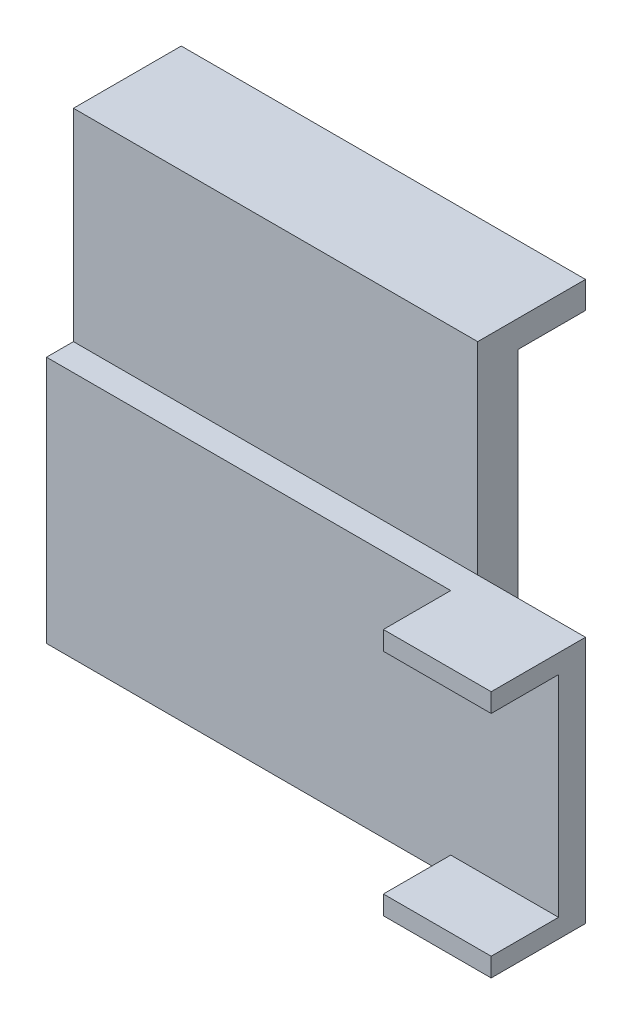
ISO-10303-21;
HEADER;
FILE_DESCRIPTION(('STEP AP214'),'2;1');
FILE_NAME('part.step','',(''),(''),'','','');
FILE_SCHEMA(('AUTOMOTIVE_DESIGN { 1 0 10303 214 1 1 1 1 }'));
ENDSEC;
DATA;
#1=APPLICATION_CONTEXT('core data for automotive mechanical design processes');
#2=APPLICATION_PROTOCOL_DEFINITION('international standard','automotive_design',2000,#1);
#3=PRODUCT_CONTEXT('',#1,'mechanical');
#4=PRODUCT('Part','Part','',(#3));
#5=PRODUCT_RELATED_PRODUCT_CATEGORY('part','',(#4));
#6=PRODUCT_DEFINITION_FORMATION('','',#4);
#7=PRODUCT_DEFINITION_CONTEXT('part definition',#1,'design');
#8=PRODUCT_DEFINITION('design','',#6,#7);
#9=PRODUCT_DEFINITION_SHAPE('','',#8);
#10=(LENGTH_UNIT() NAMED_UNIT(*) SI_UNIT(.MILLI.,.METRE.));
#11=(NAMED_UNIT(*) PLANE_ANGLE_UNIT() SI_UNIT($,.RADIAN.));
#12=(NAMED_UNIT(*) SI_UNIT($,.STERADIAN.) SOLID_ANGLE_UNIT());
#13=UNCERTAINTY_MEASURE_WITH_UNIT(LENGTH_MEASURE(1.E-05),#10,'distance_accuracy_value','');
#14=(GEOMETRIC_REPRESENTATION_CONTEXT(3) GLOBAL_UNCERTAINTY_ASSIGNED_CONTEXT((#13)) GLOBAL_UNIT_ASSIGNED_CONTEXT((#10,
#11,#12)) REPRESENTATION_CONTEXT('',''));
#15=CARTESIAN_POINT('',(0.,0.,0.));
#16=DIRECTION('',(0.,0.,1.));
#17=DIRECTION('',(1.,0.,0.));
#18=AXIS2_PLACEMENT_3D('',#15,#16,#17);
#19=CARTESIAN_POINT('',(0.0862789967610667,-0.155598995100074,-3.86375218835645));
#20=DIRECTION('',(0.,0.,1.));
#21=DIRECTION('',(1.,0.,0.));
#22=AXIS2_PLACEMENT_3D('',#19,#20,#21);
#23=PLANE('',#22);
#24=DIRECTION('',(-1.,0.,0.));
#25=VECTOR('',#24,1.);
#26=CARTESIAN_POINT('',(13.0402789967611,28.6022810048999,-3.86375218835645));
#27=LINE('',#26,#25);
#28=CARTESIAN_POINT('',(13.0402789967611,28.6022810048999,-3.86375218835645));
#29=VERTEX_POINT('',#28);
#30=CARTESIAN_POINT('',(-25.8217210032389,28.6022810048999,-3.86375218835645));
#31=VERTEX_POINT('',#30);
#32=EDGE_CURVE('E53',#29,#31,#27,.T.);
#33=ORIENTED_EDGE('',*,*,#32,.F.);
#34=DIRECTION('',(0.,-1.,0.));
#35=VECTOR('',#34,1.);
#36=CARTESIAN_POINT('',(13.0402789967611,11.7620810048999,-3.86375218835645));
#37=LINE('',#36,#35);
#38=CARTESIAN_POINT('',(13.0402789967611,-12.0732789951001,-3.86375218835645));
#39=VERTEX_POINT('',#38);
#40=EDGE_CURVE('E171',#29,#39,#37,.T.);
#41=ORIENTED_EDGE('',*,*,#40,.T.);
#42=DIRECTION('',(-1.,0.,0.));
#43=VECTOR('',#42,1.);
#44=CARTESIAN_POINT('',(-25.8217210032389,-12.0732789951001,-3.86375218835645));
#45=LINE('',#44,#43);
#46=CARTESIAN_POINT('',(-25.8217210032389,-12.0732789951001,-3.86375218835645));
#47=VERTEX_POINT('',#46);
#48=EDGE_CURVE('E183',#39,#47,#45,.T.);
#49=ORIENTED_EDGE('',*,*,#48,.T.);
#50=DIRECTION('',(0.,1.,0.));
#51=VECTOR('',#50,1.);
#52=CARTESIAN_POINT('',(-25.8217210032389,11.7620810048999,-3.86375218835645));
#53=LINE('',#52,#51);
#54=EDGE_CURVE('E179',#47,#31,#53,.T.);
#55=ORIENTED_EDGE('',*,*,#54,.T.);
#56=EDGE_LOOP('',(#33,#41,#49,#55));
#57=FACE_BOUND('',#56,.T.);
#58=ADVANCED_FACE('F36',(#57),#23,.F.);
#59=CARTESIAN_POINT('',(0.0862789967610667,-0.155598995100074,2.61324781164355));
#60=DIRECTION('',(0.,0.,-1.));
#61=DIRECTION('',(-1.,0.,0.));
#62=AXIS2_PLACEMENT_3D('',#59,#60,#61);
#63=PLANE('',#62);
#64=DIRECTION('',(-1.,0.,0.));
#65=VECTOR('',#64,1.);
#66=CARTESIAN_POINT('',(25.9942789967611,-10.2597189951001,2.61324781164355));
#67=LINE('',#66,#65);
#68=CARTESIAN_POINT('',(23.4034789967611,-10.2597189951001,2.61324781164355));
#69=VERTEX_POINT('',#68);
#70=CARTESIAN_POINT('',(13.0402789967611,-10.2597189951001,2.61324781164355));
#71=VERTEX_POINT('',#70);
#72=EDGE_CURVE('E215',#69,#71,#67,.T.);
#73=ORIENTED_EDGE('',*,*,#72,.F.);
#74=DIRECTION('',(0.,1.,0.));
#75=VECTOR('',#74,1.);
#76=CARTESIAN_POINT('',(23.4034789967611,-0.155598995100074,2.61324781164355));
#77=LINE('',#76,#75);
#78=CARTESIAN_POINT('',(23.4034789967611,9.94852100489993,2.61324781164355));
#79=VERTEX_POINT('',#78);
#80=EDGE_CURVE('E209',#69,#79,#77,.T.);
#81=ORIENTED_EDGE('',*,*,#80,.T.);
#82=DIRECTION('',(1.,0.,0.));
#83=VECTOR('',#82,1.);
#84=CARTESIAN_POINT('',(25.9942789967611,9.94852100489993,2.61324781164355));
#85=LINE('',#84,#83);
#86=CARTESIAN_POINT('',(13.0402789967611,9.94852100489993,2.61324781164355));
#87=VERTEX_POINT('',#86);
#88=EDGE_CURVE('E237',#87,#79,#85,.T.);
#89=ORIENTED_EDGE('',*,*,#88,.F.);
#90=DIRECTION('',(0.,-1.,0.));
#91=VECTOR('',#90,1.);
#92=CARTESIAN_POINT('',(13.0402789967611,11.7620810048999,2.61324781164355));
#93=LINE('',#92,#91);
#94=CARTESIAN_POINT('',(13.0402789967611,11.7620810048999,2.61324781164355));
#95=VERTEX_POINT('',#94);
#96=EDGE_CURVE('E233',#95,#87,#93,.T.);
#97=ORIENTED_EDGE('',*,*,#96,.F.);
#98=DIRECTION('',(-1.,0.,0.));
#99=VECTOR('',#98,1.);
#100=CARTESIAN_POINT('',(-25.8217210032389,11.7620810048999,2.61324781164355));
#101=LINE('',#100,#99);
#102=CARTESIAN_POINT('',(-25.8217210032389,11.7620810048999,2.61324781164355));
#103=VERTEX_POINT('',#102);
#104=EDGE_CURVE('E253',#95,#103,#101,.T.);
#105=ORIENTED_EDGE('',*,*,#104,.T.);
#106=DIRECTION('',(0.,-1.,0.));
#107=VECTOR('',#106,1.);
#108=CARTESIAN_POINT('',(-25.8217210032389,-12.0732789951001,2.61324781164355));
#109=LINE('',#108,#107);
#110=CARTESIAN_POINT('',(-25.8217210032389,-12.0732789951001,2.61324781164355));
#111=VERTEX_POINT('',#110);
#112=EDGE_CURVE('E255',#103,#111,#109,.T.);
#113=ORIENTED_EDGE('',*,*,#112,.T.);
#114=DIRECTION('',(1.,0.,0.));
#115=VECTOR('',#114,1.);
#116=CARTESIAN_POINT('',(-25.8217210032389,-12.0732789951001,2.61324781164355));
#117=LINE('',#116,#115);
#118=CARTESIAN_POINT('',(13.0402789967611,-12.0732789951001,2.61324781164355));
#119=VERTEX_POINT('',#118);
#120=EDGE_CURVE('E258',#111,#119,#117,.T.);
#121=ORIENTED_EDGE('',*,*,#120,.T.);
#122=DIRECTION('',(0.,-1.,0.));
#123=VECTOR('',#122,1.);
#124=CARTESIAN_POINT('',(13.0402789967611,-12.0732789951001,2.61324781164355));
#125=LINE('',#124,#123);
#126=EDGE_CURVE('E219',#71,#119,#125,.T.);
#127=ORIENTED_EDGE('',*,*,#126,.F.);
#128=EDGE_LOOP('',(#73,#81,#89,#97,#105,#113,#121,#127));
#129=FACE_BOUND('',#128,.T.);
#130=ADVANCED_FACE('F304',(#129),#63,.F.);
#131=CARTESIAN_POINT('',(-25.8217210032389,11.7620810048999,2.61324781164355));
#132=DIRECTION('',(0.,-1.,0.));
#133=DIRECTION('',(0.,0.,-1.));
#134=AXIS2_PLACEMENT_3D('',#131,#132,#133);
#135=PLANE('',#134);
#136=DIRECTION('',(-1.,0.,0.));
#137=VECTOR('',#136,1.);
#138=CARTESIAN_POINT('',(25.9942789967611,11.7620810048999,9.09024781164355));
#139=LINE('',#138,#137);
#140=CARTESIAN_POINT('',(23.4034789967611,11.7620810048999,9.09024781164355));
#141=VERTEX_POINT('',#140);
#142=CARTESIAN_POINT('',(13.0402789967611,11.7620810048999,9.09024781164355));
#143=VERTEX_POINT('',#142);
#144=EDGE_CURVE('E234',#141,#143,#139,.T.);
#145=ORIENTED_EDGE('',*,*,#144,.F.);
#146=DIRECTION('',(0.,0.,1.));
#147=VECTOR('',#146,1.);
#148=CARTESIAN_POINT('',(23.4034789967611,11.7620810048999,9.09024781164355));
#149=LINE('',#148,#147);
#150=CARTESIAN_POINT('',(23.4034789967611,11.7620810048999,0.0224478116435521));
#151=VERTEX_POINT('',#150);
#152=EDGE_CURVE('E195',#151,#141,#149,.T.);
#153=ORIENTED_EDGE('',*,*,#152,.F.);
#154=DIRECTION('',(-1.,0.,0.));
#155=VECTOR('',#154,1.);
#156=CARTESIAN_POINT('',(-25.8217210032389,11.7620810048999,0.0224478116435513));
#157=LINE('',#156,#155);
#158=CARTESIAN_POINT('',(13.0402789967611,11.7620810048999,0.0224478116435513));
#159=VERTEX_POINT('',#158);
#160=EDGE_CURVE('E261',#151,#159,#157,.T.);
#161=ORIENTED_EDGE('',*,*,#160,.T.);
#162=CARTESIAN_POINT('',(-25.8217210032389,11.7620810048999,0.0224478116435513));
#163=VERTEX_POINT('',#162);
#164=EDGE_CURVE('E252',#159,#163,#157,.T.);
#165=ORIENTED_EDGE('',*,*,#164,.T.);
#166=DIRECTION('',(0.,0.,-1.));
#167=VECTOR('',#166,1.);
#168=CARTESIAN_POINT('',(-25.8217210032389,11.7620810048999,2.61324781164355));
#169=LINE('',#168,#167);
#170=EDGE_CURVE('E40',#103,#163,#169,.T.);
#171=ORIENTED_EDGE('',*,*,#170,.F.);
#172=ORIENTED_EDGE('',*,*,#104,.F.);
#173=DIRECTION('',(0.,0.,-1.));
#174=VECTOR('',#173,1.);
#175=CARTESIAN_POINT('',(13.0402789967611,11.7620810048999,9.09024781164355));
#176=LINE('',#175,#174);
#177=EDGE_CURVE('E249',#143,#95,#176,.T.);
#178=ORIENTED_EDGE('',*,*,#177,.F.);
#179=EDGE_LOOP('',(#145,#153,#161,#165,#171,#172,#178));
#180=FACE_BOUND('',#179,.T.);
#181=ADVANCED_FACE('F38',(#180),#135,.F.);
#182=CARTESIAN_POINT('',(-25.8217210032389,-12.0732789951001,2.61324781164355));
#183=DIRECTION('',(1.,0.,0.));
#184=DIRECTION('',(0.,0.,-1.));
#185=AXIS2_PLACEMENT_3D('',#182,#183,#184);
#186=PLANE('',#185);
#187=ORIENTED_EDGE('',*,*,#170,.T.);
#188=DIRECTION('',(0.,1.,0.));
#189=VECTOR('',#188,1.);
#190=CARTESIAN_POINT('',(-25.8217210032389,11.7620810048999,0.0224478116435513));
#191=LINE('',#190,#189);
#192=CARTESIAN_POINT('',(-25.8217210032389,31.1930810048999,0.0224478116435513));
#193=VERTEX_POINT('',#192);
#194=EDGE_CURVE('E181',#163,#193,#191,.T.);
#195=ORIENTED_EDGE('',*,*,#194,.T.);
#196=DIRECTION('',(0.,0.,1.));
#197=VECTOR('',#196,1.);
#198=CARTESIAN_POINT('',(-25.8217210032389,31.1930810048999,-3.86375218835645));
#199=LINE('',#198,#197);
#200=CARTESIAN_POINT('',(-25.8217210032389,31.1930810048999,-10.3407521883564));
#201=VERTEX_POINT('',#200);
#202=EDGE_CURVE('E192',#201,#193,#199,.T.);
#203=ORIENTED_EDGE('',*,*,#202,.F.);
#204=DIRECTION('',(0.,1.,0.));
#205=VECTOR('',#204,1.);
#206=CARTESIAN_POINT('',(-25.8217210032389,31.1930810048999,-10.3407521883564));
#207=LINE('',#206,#205);
#208=CARTESIAN_POINT('',(-25.8217210032389,28.6022810048999,-10.3407521883564));
#209=VERTEX_POINT('',#208);
#210=EDGE_CURVE('E157',#209,#201,#207,.T.);
#211=ORIENTED_EDGE('',*,*,#210,.F.);
#212=DIRECTION('',(0.,0.,1.));
#213=VECTOR('',#212,1.);
#214=CARTESIAN_POINT('',(-25.8217210032389,28.6022810048999,-10.3407521883564));
#215=LINE('',#214,#213);
#216=EDGE_CURVE('E153',#209,#31,#215,.T.);
#217=ORIENTED_EDGE('',*,*,#216,.T.);
#218=ORIENTED_EDGE('',*,*,#54,.F.);
#219=DIRECTION('',(0.,0.,-1.));
#220=VECTOR('',#219,1.);
#221=CARTESIAN_POINT('',(-25.8217210032389,-12.0732789951001,2.61324781164355));
#222=LINE('',#221,#220);
#223=EDGE_CURVE('E260',#111,#47,#222,.T.);
#224=ORIENTED_EDGE('',*,*,#223,.F.);
#225=ORIENTED_EDGE('',*,*,#112,.F.);
#226=EDGE_LOOP('',(#187,#195,#203,#211,#217,#218,#224,#225));
#227=FACE_BOUND('',#226,.T.);
#228=ADVANCED_FACE('F273',(#227),#186,.F.);
#229=CARTESIAN_POINT('',(-25.8217210032389,-12.0732789951001,2.61324781164355));
#230=DIRECTION('',(0.,1.,0.));
#231=DIRECTION('',(0.,0.,1.));
#232=AXIS2_PLACEMENT_3D('',#229,#230,#231);
#233=PLANE('',#232);
#234=ORIENTED_EDGE('',*,*,#223,.T.);
#235=ORIENTED_EDGE('',*,*,#48,.F.);
#236=DIRECTION('',(0.,0.,1.));
#237=VECTOR('',#236,1.);
#238=CARTESIAN_POINT('',(13.0402789967611,-12.0732789951001,-3.86375218835645));
#239=LINE('',#238,#237);
#240=CARTESIAN_POINT('',(13.0402789967611,-12.0732789951001,0.0224478116435513));
#241=VERTEX_POINT('',#240);
#242=EDGE_CURVE('E185',#39,#241,#239,.T.);
#243=ORIENTED_EDGE('',*,*,#242,.T.);
#244=DIRECTION('',(1.,0.,0.));
#245=VECTOR('',#244,1.);
#246=CARTESIAN_POINT('',(-25.8217210032389,-12.0732789951001,0.0224478116435513));
#247=LINE('',#246,#245);
#248=CARTESIAN_POINT('',(23.4034789967611,-12.0732789951001,0.0224478116435521));
#249=VERTEX_POINT('',#248);
#250=EDGE_CURVE('E256',#241,#249,#247,.T.);
#251=ORIENTED_EDGE('',*,*,#250,.T.);
#252=DIRECTION('',(0.,0.,1.));
#253=VECTOR('',#252,1.);
#254=CARTESIAN_POINT('',(23.4034789967611,-12.0732789951001,9.09024781164355));
#255=LINE('',#254,#253);
#256=CARTESIAN_POINT('',(23.4034789967611,-12.0732789951001,9.09024781164355));
#257=VERTEX_POINT('',#256);
#258=EDGE_CURVE('E196',#249,#257,#255,.T.);
#259=ORIENTED_EDGE('',*,*,#258,.T.);
#260=DIRECTION('',(1.,0.,0.));
#261=VECTOR('',#260,1.);
#262=CARTESIAN_POINT('',(25.9942789967611,-12.0732789951001,9.09024781164355));
#263=LINE('',#262,#261);
#264=CARTESIAN_POINT('',(13.0402789967611,-12.0732789951001,9.09024781164355));
#265=VERTEX_POINT('',#264);
#266=EDGE_CURVE('E221',#265,#257,#263,.T.);
#267=ORIENTED_EDGE('',*,*,#266,.F.);
#268=DIRECTION('',(0.,0.,-1.));
#269=VECTOR('',#268,1.);
#270=CARTESIAN_POINT('',(13.0402789967611,-12.0732789951001,9.09024781164355));
#271=LINE('',#270,#269);
#272=EDGE_CURVE('E224',#265,#119,#271,.T.);
#273=ORIENTED_EDGE('',*,*,#272,.T.);
#274=ORIENTED_EDGE('',*,*,#120,.F.);
#275=EDGE_LOOP('',(#234,#235,#243,#251,#259,#267,#273,#274));
#276=FACE_BOUND('',#275,.T.);
#277=ADVANCED_FACE('F284',(#276),#233,.F.);
#278=CARTESIAN_POINT('',(0.0862789967610667,-0.155598995100074,0.0224478116435513));
#279=DIRECTION('',(0.,0.,-1.));
#280=DIRECTION('',(-1.,0.,0.));
#281=AXIS2_PLACEMENT_3D('',#278,#279,#280);
#282=PLANE('',#281);
#283=DIRECTION('',(0.,-1.,0.));
#284=VECTOR('',#283,1.);
#285=CARTESIAN_POINT('',(13.0402789967611,11.7620810048999,0.0224478116435513));
#286=LINE('',#285,#284);
#287=EDGE_CURVE('E11',#159,#241,#286,.T.);
#288=ORIENTED_EDGE('',*,*,#287,.F.);
#289=ORIENTED_EDGE('',*,*,#160,.F.);
#290=DIRECTION('',(0.,1.,0.));
#291=VECTOR('',#290,1.);
#292=CARTESIAN_POINT('',(23.4034789967611,-12.0732789951001,0.0224478116435521));
#293=LINE('',#292,#291);
#294=EDGE_CURVE('E199',#249,#151,#293,.T.);
#295=ORIENTED_EDGE('',*,*,#294,.F.);
#296=ORIENTED_EDGE('',*,*,#250,.F.);
#297=EDGE_LOOP('',(#288,#289,#295,#296));
#298=FACE_BOUND('',#297,.T.);
#299=ADVANCED_FACE('F291',(#298),#282,.T.);
#300=CARTESIAN_POINT('',(13.0402789967611,11.7620810048999,9.09024781164355));
#301=DIRECTION('',(1.,0.,0.));
#302=DIRECTION('',(0.,0.,-1.));
#303=AXIS2_PLACEMENT_3D('',#300,#301,#302);
#304=PLANE('',#303);
#305=ORIENTED_EDGE('',*,*,#96,.T.);
#306=DIRECTION('',(0.,0.,-1.));
#307=VECTOR('',#306,1.);
#308=CARTESIAN_POINT('',(13.0402789967611,9.94852100489993,9.09024781164355));
#309=LINE('',#308,#307);
#310=CARTESIAN_POINT('',(13.0402789967611,9.94852100489993,9.09024781164355));
#311=VERTEX_POINT('',#310);
#312=EDGE_CURVE('E242',#311,#87,#309,.T.);
#313=ORIENTED_EDGE('',*,*,#312,.F.);
#314=DIRECTION('',(0.,-1.,0.));
#315=VECTOR('',#314,1.);
#316=CARTESIAN_POINT('',(13.0402789967611,11.7620810048999,9.09024781164355));
#317=LINE('',#316,#315);
#318=EDGE_CURVE('E236',#143,#311,#317,.T.);
#319=ORIENTED_EDGE('',*,*,#318,.F.);
#320=ORIENTED_EDGE('',*,*,#177,.T.);
#321=EDGE_LOOP('',(#305,#313,#319,#320));
#322=FACE_BOUND('',#321,.T.);
#323=ADVANCED_FACE('F424',(#322),#304,.F.);
#324=CARTESIAN_POINT('',(25.9942789967611,9.94852100489993,9.09024781164355));
#325=DIRECTION('',(0.,1.,0.));
#326=DIRECTION('',(-1.,0.,0.));
#327=AXIS2_PLACEMENT_3D('',#324,#325,#326);
#328=PLANE('',#327);
#329=ORIENTED_EDGE('',*,*,#88,.T.);
#330=DIRECTION('',(0.,0.,1.));
#331=VECTOR('',#330,1.);
#332=CARTESIAN_POINT('',(23.4034789967611,9.94852100489993,9.09024781164355));
#333=LINE('',#332,#331);
#334=CARTESIAN_POINT('',(23.4034789967611,9.94852100489993,9.09024781164355));
#335=VERTEX_POINT('',#334);
#336=EDGE_CURVE('E212',#79,#335,#333,.T.);
#337=ORIENTED_EDGE('',*,*,#336,.T.);
#338=DIRECTION('',(1.,0.,0.));
#339=VECTOR('',#338,1.);
#340=CARTESIAN_POINT('',(25.9942789967611,9.94852100489993,9.09024781164355));
#341=LINE('',#340,#339);
#342=EDGE_CURVE('E239',#311,#335,#341,.T.);
#343=ORIENTED_EDGE('',*,*,#342,.F.);
#344=ORIENTED_EDGE('',*,*,#312,.T.);
#345=EDGE_LOOP('',(#329,#337,#343,#344));
#346=FACE_BOUND('',#345,.T.);
#347=ADVANCED_FACE('F301',(#346),#328,.F.);
#348=CARTESIAN_POINT('',(0.0862789967610667,-0.155598995100074,9.09024781164355));
#349=DIRECTION('',(0.,0.,-1.));
#350=DIRECTION('',(-1.,0.,0.));
#351=AXIS2_PLACEMENT_3D('',#348,#349,#350);
#352=PLANE('',#351);
#353=ORIENTED_EDGE('',*,*,#342,.T.);
#354=DIRECTION('',(0.,1.,0.));
#355=VECTOR('',#354,1.);
#356=CARTESIAN_POINT('',(23.4034789967611,-12.0732789951001,9.09024781164355));
#357=LINE('',#356,#355);
#358=EDGE_CURVE('E205',#335,#141,#357,.T.);
#359=ORIENTED_EDGE('',*,*,#358,.T.);
#360=ORIENTED_EDGE('',*,*,#144,.T.);
#361=ORIENTED_EDGE('',*,*,#318,.T.);
#362=EDGE_LOOP('',(#353,#359,#360,#361));
#363=FACE_BOUND('',#362,.T.);
#364=ADVANCED_FACE('F296',(#363),#352,.F.);
#365=CARTESIAN_POINT('',(25.9942789967611,-10.2597189951001,9.09024781164355));
#366=DIRECTION('',(0.,-1.,0.));
#367=DIRECTION('',(1.,0.,0.));
#368=AXIS2_PLACEMENT_3D('',#365,#366,#367);
#369=PLANE('',#368);
#370=DIRECTION('',(-1.,0.,0.));
#371=VECTOR('',#370,1.);
#372=CARTESIAN_POINT('',(25.9942789967611,-10.2597189951001,9.09024781164355));
#373=LINE('',#372,#371);
#374=CARTESIAN_POINT('',(23.4034789967611,-10.2597189951001,9.09024781164355));
#375=VERTEX_POINT('',#374);
#376=CARTESIAN_POINT('',(13.0402789967611,-10.2597189951001,9.09024781164355));
#377=VERTEX_POINT('',#376);
#378=EDGE_CURVE('E216',#375,#377,#373,.T.);
#379=ORIENTED_EDGE('',*,*,#378,.F.);
#380=DIRECTION('',(0.,0.,-1.));
#381=VECTOR('',#380,1.);
#382=CARTESIAN_POINT('',(23.4034789967611,-10.2597189951001,9.09024781164355));
#383=LINE('',#382,#381);
#384=EDGE_CURVE('E204',#375,#69,#383,.T.);
#385=ORIENTED_EDGE('',*,*,#384,.T.);
#386=ORIENTED_EDGE('',*,*,#72,.T.);
#387=DIRECTION('',(0.,0.,-1.));
#388=VECTOR('',#387,1.);
#389=CARTESIAN_POINT('',(13.0402789967611,-10.2597189951001,9.09024781164355));
#390=LINE('',#389,#388);
#391=EDGE_CURVE('E230',#377,#71,#390,.T.);
#392=ORIENTED_EDGE('',*,*,#391,.F.);
#393=EDGE_LOOP('',(#379,#385,#386,#392));
#394=FACE_BOUND('',#393,.T.);
#395=ADVANCED_FACE('F309',(#394),#369,.F.);
#396=CARTESIAN_POINT('',(13.0402789967611,-12.0732789951001,9.09024781164355));
#397=DIRECTION('',(1.,0.,0.));
#398=DIRECTION('',(0.,1.,0.));
#399=AXIS2_PLACEMENT_3D('',#396,#397,#398);
#400=PLANE('',#399);
#401=ORIENTED_EDGE('',*,*,#126,.T.);
#402=ORIENTED_EDGE('',*,*,#272,.F.);
#403=DIRECTION('',(0.,-1.,0.));
#404=VECTOR('',#403,1.);
#405=CARTESIAN_POINT('',(13.0402789967611,-12.0732789951001,9.09024781164355));
#406=LINE('',#405,#404);
#407=EDGE_CURVE('E218',#377,#265,#406,.T.);
#408=ORIENTED_EDGE('',*,*,#407,.F.);
#409=ORIENTED_EDGE('',*,*,#391,.T.);
#410=EDGE_LOOP('',(#401,#402,#408,#409));
#411=FACE_BOUND('',#410,.T.);
#412=ADVANCED_FACE('F315',(#411),#400,.F.);
#413=CARTESIAN_POINT('',(0.0862789967610667,-0.155598995100074,9.09024781164355));
#414=DIRECTION('',(0.,0.,1.));
#415=DIRECTION('',(1.,0.,0.));
#416=AXIS2_PLACEMENT_3D('',#413,#414,#415);
#417=PLANE('',#416);
#418=EDGE_CURVE('E201',#257,#375,#357,.T.);
#419=ORIENTED_EDGE('',*,*,#418,.T.);
#420=ORIENTED_EDGE('',*,*,#378,.T.);
#421=ORIENTED_EDGE('',*,*,#407,.T.);
#422=ORIENTED_EDGE('',*,*,#266,.T.);
#423=EDGE_LOOP('',(#419,#420,#421,#422));
#424=FACE_BOUND('',#423,.T.);
#425=ADVANCED_FACE('F312',(#424),#417,.T.);
#426=CARTESIAN_POINT('',(23.4034789967611,-12.0732789951001,9.09024781164355));
#427=DIRECTION('',(-1.,0.,0.));
#428=DIRECTION('',(0.,0.,1.));
#429=AXIS2_PLACEMENT_3D('',#426,#427,#428);
#430=PLANE('',#429);
#431=ORIENTED_EDGE('',*,*,#80,.F.);
#432=ORIENTED_EDGE('',*,*,#384,.F.);
#433=ORIENTED_EDGE('',*,*,#418,.F.);
#434=ORIENTED_EDGE('',*,*,#258,.F.);
#435=ORIENTED_EDGE('',*,*,#294,.T.);
#436=ORIENTED_EDGE('',*,*,#152,.T.);
#437=ORIENTED_EDGE('',*,*,#358,.F.);
#438=ORIENTED_EDGE('',*,*,#336,.F.);
#439=EDGE_LOOP('',(#431,#432,#433,#434,#435,#436,#437,#438));
#440=FACE_BOUND('',#439,.T.);
#441=ADVANCED_FACE('F289',(#440),#430,.F.);
#442=CARTESIAN_POINT('',(0.0862789967610667,-0.155598995100074,0.0224478116435513));
#443=DIRECTION('',(0.,0.,1.));
#444=DIRECTION('',(1.,0.,0.));
#445=AXIS2_PLACEMENT_3D('',#442,#443,#444);
#446=PLANE('',#445);
#447=ORIENTED_EDGE('',*,*,#164,.F.);
#448=CARTESIAN_POINT('',(13.0402789967611,31.1930810048999,0.0224478116435513));
#449=VERTEX_POINT('',#448);
#450=EDGE_CURVE('E46',#449,#159,#286,.T.);
#451=ORIENTED_EDGE('',*,*,#450,.F.);
#452=DIRECTION('',(1.,0.,0.));
#453=VECTOR('',#452,1.);
#454=CARTESIAN_POINT('',(13.0402789967611,31.1930810048999,0.0224478116435513));
#455=LINE('',#454,#453);
#456=EDGE_CURVE('E172',#193,#449,#455,.T.);
#457=ORIENTED_EDGE('',*,*,#456,.F.);
#458=ORIENTED_EDGE('',*,*,#194,.F.);
#459=EDGE_LOOP('',(#447,#451,#457,#458));
#460=FACE_BOUND('',#459,.T.);
#461=ADVANCED_FACE('F279',(#460),#446,.T.);
#462=CARTESIAN_POINT('',(13.0402789967611,31.1930810048999,-3.86375218835645));
#463=DIRECTION('',(0.,-1.,0.));
#464=DIRECTION('',(0.,0.,-1.));
#465=AXIS2_PLACEMENT_3D('',#462,#463,#464);
#466=PLANE('',#465);
#467=ORIENTED_EDGE('',*,*,#456,.T.);
#468=DIRECTION('',(0.,0.,1.));
#469=VECTOR('',#468,1.);
#470=CARTESIAN_POINT('',(13.0402789967611,31.1930810048999,-3.86375218835645));
#471=LINE('',#470,#469);
#472=CARTESIAN_POINT('',(13.0402789967611,31.1930810048999,-10.3407521883564));
#473=VERTEX_POINT('',#472);
#474=EDGE_CURVE('E190',#473,#449,#471,.T.);
#475=ORIENTED_EDGE('',*,*,#474,.F.);
#476=DIRECTION('',(1.,0.,0.));
#477=VECTOR('',#476,1.);
#478=CARTESIAN_POINT('',(13.0402789967611,31.1930810048999,-10.3407521883564));
#479=LINE('',#478,#477);
#480=EDGE_CURVE('E164',#201,#473,#479,.T.);
#481=ORIENTED_EDGE('',*,*,#480,.F.);
#482=ORIENTED_EDGE('',*,*,#202,.T.);
#483=EDGE_LOOP('',(#467,#475,#481,#482));
#484=FACE_BOUND('',#483,.T.);
#485=ADVANCED_FACE('F281',(#484),#466,.F.);
#486=CARTESIAN_POINT('',(13.0402789967611,11.7620810048999,-3.86375218835645));
#487=DIRECTION('',(-1.,0.,0.));
#488=DIRECTION('',(0.,-1.,0.));
#489=AXIS2_PLACEMENT_3D('',#486,#487,#488);
#490=PLANE('',#489);
#491=ORIENTED_EDGE('',*,*,#450,.T.);
#492=ORIENTED_EDGE('',*,*,#287,.T.);
#493=ORIENTED_EDGE('',*,*,#242,.F.);
#494=ORIENTED_EDGE('',*,*,#40,.F.);
#495=DIRECTION('',(0.,0.,1.));
#496=VECTOR('',#495,1.);
#497=CARTESIAN_POINT('',(13.0402789967611,28.6022810048999,-10.3407521883564));
#498=LINE('',#497,#496);
#499=CARTESIAN_POINT('',(13.0402789967611,28.6022810048999,-10.3407521883564));
#500=VERTEX_POINT('',#499);
#501=EDGE_CURVE('E151',#500,#29,#498,.T.);
#502=ORIENTED_EDGE('',*,*,#501,.F.);
#503=DIRECTION('',(0.,-1.,0.));
#504=VECTOR('',#503,1.);
#505=CARTESIAN_POINT('',(13.0402789967611,31.1930810048999,-10.3407521883564));
#506=LINE('',#505,#504);
#507=EDGE_CURVE('E158',#473,#500,#506,.T.);
#508=ORIENTED_EDGE('',*,*,#507,.F.);
#509=ORIENTED_EDGE('',*,*,#474,.T.);
#510=EDGE_LOOP('',(#491,#492,#493,#494,#502,#508,#509));
#511=FACE_BOUND('',#510,.T.);
#512=ADVANCED_FACE('F169',(#511),#490,.F.);
#513=CARTESIAN_POINT('',(13.0402789967611,28.6022810048999,-10.3407521883564));
#514=DIRECTION('',(0.,1.,0.));
#515=DIRECTION('',(0.,0.,1.));
#516=AXIS2_PLACEMENT_3D('',#513,#514,#515);
#517=PLANE('',#516);
#518=ORIENTED_EDGE('',*,*,#32,.T.);
#519=ORIENTED_EDGE('',*,*,#216,.F.);
#520=DIRECTION('',(-1.,0.,0.));
#521=VECTOR('',#520,1.);
#522=CARTESIAN_POINT('',(13.0402789967611,28.6022810048999,-10.3407521883564));
#523=LINE('',#522,#521);
#524=EDGE_CURVE('E147',#500,#209,#523,.T.);
#525=ORIENTED_EDGE('',*,*,#524,.F.);
#526=ORIENTED_EDGE('',*,*,#501,.T.);
#527=EDGE_LOOP('',(#518,#519,#525,#526));
#528=FACE_BOUND('',#527,.T.);
#529=ADVANCED_FACE('F149',(#528),#517,.F.);
#530=CARTESIAN_POINT('',(0.0862789967610667,-0.155598995100074,-10.3407521883564));
#531=DIRECTION('',(0.,0.,-1.));
#532=DIRECTION('',(-1.,0.,0.));
#533=AXIS2_PLACEMENT_3D('',#530,#531,#532);
#534=PLANE('',#533);
#535=ORIENTED_EDGE('',*,*,#507,.T.);
#536=ORIENTED_EDGE('',*,*,#524,.T.);
#537=ORIENTED_EDGE('',*,*,#210,.T.);
#538=ORIENTED_EDGE('',*,*,#480,.T.);
#539=EDGE_LOOP('',(#535,#536,#537,#538));
#540=FACE_BOUND('',#539,.T.);
#541=ADVANCED_FACE('F162',(#540),#534,.T.);
#542=CLOSED_SHELL('',(#58,#130,#181,#228,#277,#299,#323,#347,#364,#395,#412,#425,#441,#461,#485,
#512,#529,#541));
#543=MANIFOLD_SOLID_BREP('B2',#542);
#544=ADVANCED_BREP_SHAPE_REPRESENTATION('',(#18,#543),#14);
#545=SHAPE_DEFINITION_REPRESENTATION(#9,#544);
ENDSEC;
END-ISO-10303-21;
